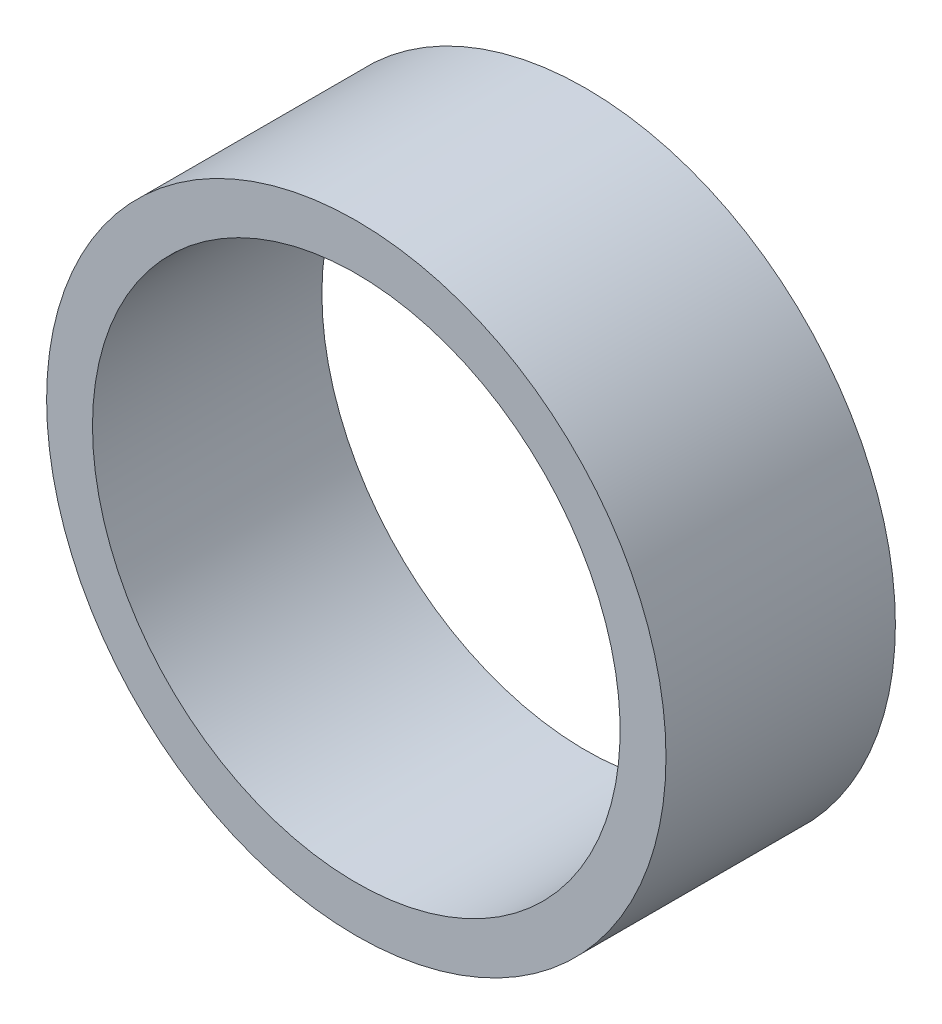
ISO-10303-21;
HEADER;
FILE_DESCRIPTION(('STEP AP214'),'2;1');
FILE_NAME('part.step','',(''),(''),'','','');
FILE_SCHEMA(('AUTOMOTIVE_DESIGN { 1 0 10303 214 1 1 1 1 }'));
ENDSEC;
DATA;
#1=APPLICATION_CONTEXT('core data for automotive mechanical design processes');
#2=APPLICATION_PROTOCOL_DEFINITION('international standard','automotive_design',2000,#1);
#3=PRODUCT_CONTEXT('',#1,'mechanical');
#4=PRODUCT('Part','Part','',(#3));
#5=PRODUCT_RELATED_PRODUCT_CATEGORY('part','',(#4));
#6=PRODUCT_DEFINITION_FORMATION('','',#4);
#7=PRODUCT_DEFINITION_CONTEXT('part definition',#1,'design');
#8=PRODUCT_DEFINITION('design','',#6,#7);
#9=PRODUCT_DEFINITION_SHAPE('','',#8);
#10=(LENGTH_UNIT() NAMED_UNIT(*) SI_UNIT(.MILLI.,.METRE.));
#11=(NAMED_UNIT(*) PLANE_ANGLE_UNIT() SI_UNIT($,.RADIAN.));
#12=(NAMED_UNIT(*) SI_UNIT($,.STERADIAN.) SOLID_ANGLE_UNIT());
#13=UNCERTAINTY_MEASURE_WITH_UNIT(LENGTH_MEASURE(1.E-05),#10,'distance_accuracy_value','');
#14=(GEOMETRIC_REPRESENTATION_CONTEXT(3) GLOBAL_UNCERTAINTY_ASSIGNED_CONTEXT((#13)) GLOBAL_UNIT_ASSIGNED_CONTEXT((#10,
#11,#12)) REPRESENTATION_CONTEXT('',''));
#15=CARTESIAN_POINT('',(0.,0.,0.));
#16=DIRECTION('',(0.,0.,1.));
#17=DIRECTION('',(1.,0.,0.));
#18=AXIS2_PLACEMENT_3D('',#15,#16,#17);
#19=CARTESIAN_POINT('',(0.,0.,-1.));
#20=DIRECTION('',(0.,0.,1.));
#21=DIRECTION('',(1.,0.,0.));
#22=AXIS2_PLACEMENT_3D('',#19,#20,#21);
#23=CYLINDRICAL_SURFACE('',#22,1.35);
#24=CARTESIAN_POINT('',(0.,0.,-1.));
#25=DIRECTION('',(0.,0.,1.));
#26=DIRECTION('',(1.,0.,0.));
#27=AXIS2_PLACEMENT_3D('',#24,#25,#26);
#28=CIRCLE('',#27,1.35);
#29=CARTESIAN_POINT('',(1.35,0.,-1.));
#30=VERTEX_POINT('',#29);
#31=EDGE_CURVE('E12',#30,#30,#28,.T.);
#32=ORIENTED_EDGE('',*,*,#31,.T.);
#33=EDGE_LOOP('',(#32));
#34=FACE_BOUND('',#33,.T.);
#35=CARTESIAN_POINT('',(0.,0.,0.));
#36=DIRECTION('',(0.,0.,1.));
#37=DIRECTION('',(1.,0.,0.));
#38=AXIS2_PLACEMENT_3D('',#35,#36,#37);
#39=CIRCLE('',#38,1.35);
#40=CARTESIAN_POINT('',(1.35,0.,0.));
#41=VERTEX_POINT('',#40);
#42=EDGE_CURVE('E49',#41,#41,#39,.T.);
#43=ORIENTED_EDGE('',*,*,#42,.F.);
#44=EDGE_LOOP('',(#43));
#45=FACE_BOUND('',#44,.T.);
#46=ADVANCED_FACE('F46',(#34,#45),#23,.T.);
#47=CARTESIAN_POINT('',(0.,0.,-1.));
#48=DIRECTION('',(0.,0.,1.));
#49=DIRECTION('',(1.,0.,0.));
#50=AXIS2_PLACEMENT_3D('',#47,#48,#49);
#51=PLANE('',#50);
#52=CARTESIAN_POINT('',(0.,0.,-1.));
#53=DIRECTION('',(0.,0.,-1.));
#54=DIRECTION('',(-1.,0.,0.));
#55=AXIS2_PLACEMENT_3D('',#52,#53,#54);
#56=CIRCLE('',#55,1.15);
#57=CARTESIAN_POINT('',(-1.15,0.,-1.));
#58=VERTEX_POINT('',#57);
#59=EDGE_CURVE('E58',#58,#58,#56,.T.);
#60=ORIENTED_EDGE('',*,*,#59,.F.);
#61=EDGE_LOOP('',(#60));
#62=FACE_BOUND('',#61,.T.);
#63=ORIENTED_EDGE('',*,*,#31,.F.);
#64=EDGE_LOOP('',(#63));
#65=FACE_BOUND('',#64,.T.);
#66=ADVANCED_FACE('F73',(#62,#65),#51,.F.);
#67=CARTESIAN_POINT('',(0.,0.,0.));
#68=DIRECTION('',(0.,0.,1.));
#69=DIRECTION('',(1.,0.,0.));
#70=AXIS2_PLACEMENT_3D('',#67,#68,#69);
#71=PLANE('',#70);
#72=CARTESIAN_POINT('',(0.,0.,0.));
#73=DIRECTION('',(0.,0.,-1.));
#74=DIRECTION('',(-1.,0.,0.));
#75=AXIS2_PLACEMENT_3D('',#72,#73,#74);
#76=CIRCLE('',#75,1.15);
#77=CARTESIAN_POINT('',(-1.15,0.,0.));
#78=VERTEX_POINT('',#77);
#79=EDGE_CURVE('E56',#78,#78,#76,.T.);
#80=ORIENTED_EDGE('',*,*,#79,.T.);
#81=EDGE_LOOP('',(#80));
#82=FACE_BOUND('',#81,.T.);
#83=ORIENTED_EDGE('',*,*,#42,.T.);
#84=EDGE_LOOP('',(#83));
#85=FACE_BOUND('',#84,.T.);
#86=ADVANCED_FACE('F64',(#82,#85),#71,.T.);
#87=CARTESIAN_POINT('',(0.,0.,0.));
#88=DIRECTION('',(0.,0.,-1.));
#89=DIRECTION('',(-1.,0.,0.));
#90=AXIS2_PLACEMENT_3D('',#87,#88,#89);
#91=CYLINDRICAL_SURFACE('',#90,1.15);
#92=ORIENTED_EDGE('',*,*,#79,.F.);
#93=EDGE_LOOP('',(#92));
#94=FACE_BOUND('',#93,.T.);
#95=ORIENTED_EDGE('',*,*,#59,.T.);
#96=EDGE_LOOP('',(#95));
#97=FACE_BOUND('',#96,.T.);
#98=ADVANCED_FACE('F67',(#94,#97),#91,.F.);
#99=CLOSED_SHELL('',(#46,#66,#86,#98));
#100=MANIFOLD_SOLID_BREP('B2',#99);
#101=ADVANCED_BREP_SHAPE_REPRESENTATION('',(#18,#100),#14);
#102=SHAPE_DEFINITION_REPRESENTATION(#9,#101);
ENDSEC;
END-ISO-10303-21;
